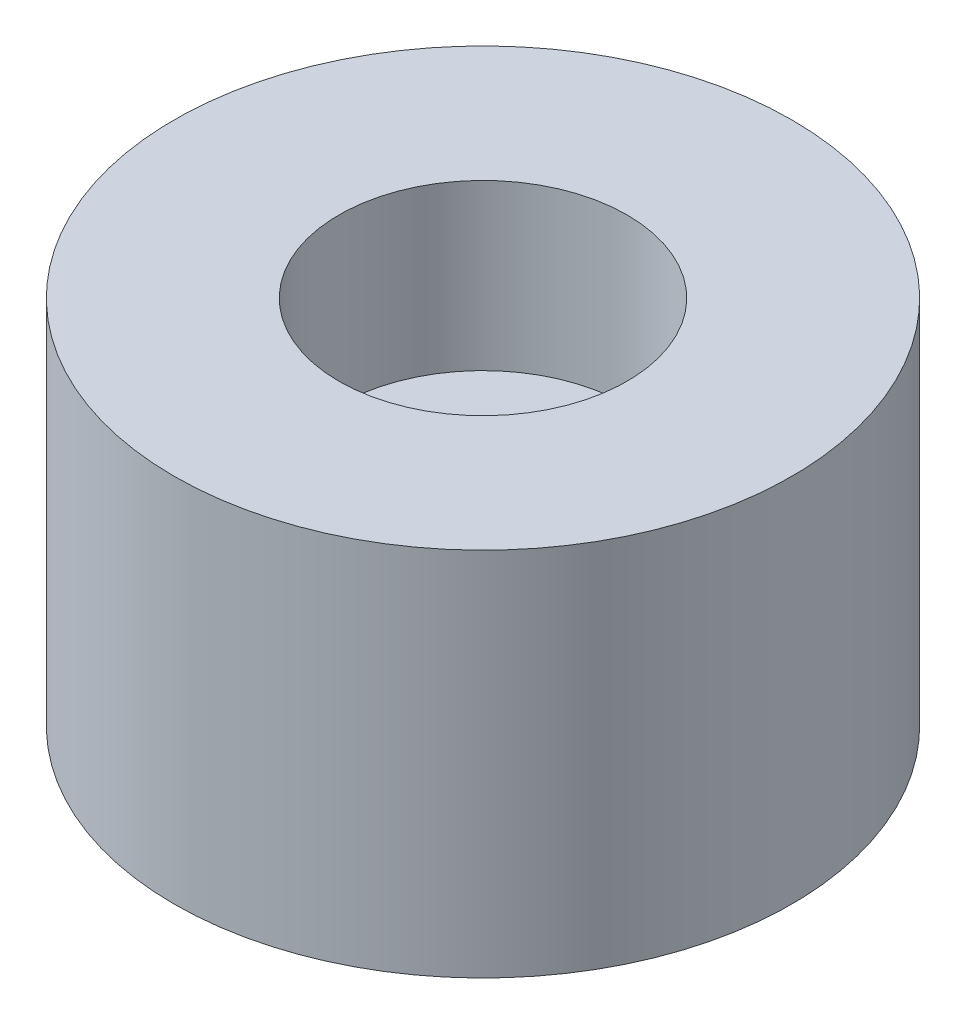
ISO-10303-21;
HEADER;
FILE_DESCRIPTION(('STEP AP214'),'2;1');
FILE_NAME('part.step','',(''),(''),'','','');
FILE_SCHEMA(('AUTOMOTIVE_DESIGN { 1 0 10303 214 1 1 1 1 }'));
ENDSEC;
DATA;
#1=APPLICATION_CONTEXT('core data for automotive mechanical design processes');
#2=APPLICATION_PROTOCOL_DEFINITION('international standard','automotive_design',2000,#1);
#3=PRODUCT_CONTEXT('',#1,'mechanical');
#4=PRODUCT('Part','Part','',(#3));
#5=PRODUCT_RELATED_PRODUCT_CATEGORY('part','',(#4));
#6=PRODUCT_DEFINITION_FORMATION('','',#4);
#7=PRODUCT_DEFINITION_CONTEXT('part definition',#1,'design');
#8=PRODUCT_DEFINITION('design','',#6,#7);
#9=PRODUCT_DEFINITION_SHAPE('','',#8);
#10=(LENGTH_UNIT() NAMED_UNIT(*) SI_UNIT(.MILLI.,.METRE.));
#11=(NAMED_UNIT(*) PLANE_ANGLE_UNIT() SI_UNIT($,.RADIAN.));
#12=(NAMED_UNIT(*) SI_UNIT($,.STERADIAN.) SOLID_ANGLE_UNIT());
#13=UNCERTAINTY_MEASURE_WITH_UNIT(LENGTH_MEASURE(1.E-05),#10,'distance_accuracy_value','');
#14=(GEOMETRIC_REPRESENTATION_CONTEXT(3) GLOBAL_UNCERTAINTY_ASSIGNED_CONTEXT((#13)) GLOBAL_UNIT_ASSIGNED_CONTEXT((#10,
#11,#12)) REPRESENTATION_CONTEXT('',''));
#15=CARTESIAN_POINT('',(0.,0.,0.));
#16=DIRECTION('',(0.,0.,1.));
#17=DIRECTION('',(1.,0.,0.));
#18=AXIS2_PLACEMENT_3D('',#15,#16,#17);
#19=CARTESIAN_POINT('',(0.,0.,0.));
#20=DIRECTION('',(0.,-1.,0.));
#21=DIRECTION('',(0.,0.,-1.));
#22=AXIS2_PLACEMENT_3D('',#19,#20,#21);
#23=CYLINDRICAL_SURFACE('',#22,7.5);
#24=CARTESIAN_POINT('',(0.,9.,0.));
#25=DIRECTION('',(0.,-1.,0.));
#26=DIRECTION('',(0.,0.,-1.));
#27=AXIS2_PLACEMENT_3D('',#24,#25,#26);
#28=CIRCLE('',#27,7.5);
#29=CARTESIAN_POINT('',(0.,9.,-7.5));
#30=VERTEX_POINT('',#29);
#31=EDGE_CURVE('E10',#30,#30,#28,.T.);
#32=ORIENTED_EDGE('',*,*,#31,.T.);
#33=EDGE_LOOP('',(#32));
#34=FACE_BOUND('',#33,.T.);
#35=CARTESIAN_POINT('',(0.,0.,0.));
#36=DIRECTION('',(0.,-1.,0.));
#37=DIRECTION('',(0.,0.,-1.));
#38=AXIS2_PLACEMENT_3D('',#35,#36,#37);
#39=CIRCLE('',#38,7.5);
#40=CARTESIAN_POINT('',(0.,0.,-7.5));
#41=VERTEX_POINT('',#40);
#42=EDGE_CURVE('E70',#41,#41,#39,.T.);
#43=ORIENTED_EDGE('',*,*,#42,.F.);
#44=EDGE_LOOP('',(#43));
#45=FACE_BOUND('',#44,.T.);
#46=ADVANCED_FACE('F43',(#34,#45),#23,.T.);
#47=CARTESIAN_POINT('',(7.5,9.,0.));
#48=DIRECTION('',(0.,1.,0.));
#49=DIRECTION('',(0.,0.,1.));
#50=AXIS2_PLACEMENT_3D('',#47,#48,#49);
#51=PLANE('',#50);
#52=CARTESIAN_POINT('',(0.,9.,0.));
#53=DIRECTION('',(0.,-1.,0.));
#54=DIRECTION('',(0.,0.,-1.));
#55=AXIS2_PLACEMENT_3D('',#52,#53,#54);
#56=CIRCLE('',#55,3.5);
#57=CARTESIAN_POINT('',(0.,9.,-3.5));
#58=VERTEX_POINT('',#57);
#59=EDGE_CURVE('E50',#58,#58,#56,.T.);
#60=ORIENTED_EDGE('',*,*,#59,.T.);
#61=EDGE_LOOP('',(#60));
#62=FACE_BOUND('',#61,.T.);
#63=ORIENTED_EDGE('',*,*,#31,.F.);
#64=EDGE_LOOP('',(#63));
#65=FACE_BOUND('',#64,.T.);
#66=ADVANCED_FACE('F79',(#62,#65),#51,.T.);
#67=CARTESIAN_POINT('',(0.,0.,0.));
#68=DIRECTION('',(0.,-1.,0.));
#69=DIRECTION('',(0.,0.,-1.));
#70=AXIS2_PLACEMENT_3D('',#67,#68,#69);
#71=CYLINDRICAL_SURFACE('',#70,3.5);
#72=CARTESIAN_POINT('',(0.,5.,0.));
#73=DIRECTION('',(0.,-1.,0.));
#74=DIRECTION('',(0.,0.,-1.));
#75=AXIS2_PLACEMENT_3D('',#72,#73,#74);
#76=CIRCLE('',#75,3.5);
#77=CARTESIAN_POINT('',(0.,5.,-3.5));
#78=VERTEX_POINT('',#77);
#79=EDGE_CURVE('E55',#78,#78,#76,.T.);
#80=ORIENTED_EDGE('',*,*,#79,.T.);
#81=EDGE_LOOP('',(#80));
#82=FACE_BOUND('',#81,.T.);
#83=ORIENTED_EDGE('',*,*,#59,.F.);
#84=EDGE_LOOP('',(#83));
#85=FACE_BOUND('',#84,.T.);
#86=ADVANCED_FACE('F83',(#82,#85),#71,.F.);
#87=CARTESIAN_POINT('',(3.5,5.,0.));
#88=DIRECTION('',(0.,1.,0.));
#89=DIRECTION('',(0.,0.,1.));
#90=AXIS2_PLACEMENT_3D('',#87,#88,#89);
#91=PLANE('',#90);
#92=CARTESIAN_POINT('',(0.,5.,0.));
#93=DIRECTION('',(0.,-1.,0.));
#94=DIRECTION('',(0.,0.,-1.));
#95=AXIS2_PLACEMENT_3D('',#92,#93,#94);
#96=CIRCLE('',#95,1.75);
#97=CARTESIAN_POINT('',(0.,5.,-1.75));
#98=VERTEX_POINT('',#97);
#99=EDGE_CURVE('E60',#98,#98,#96,.T.);
#100=ORIENTED_EDGE('',*,*,#99,.T.);
#101=EDGE_LOOP('',(#100));
#102=FACE_BOUND('',#101,.T.);
#103=ORIENTED_EDGE('',*,*,#79,.F.);
#104=EDGE_LOOP('',(#103));
#105=FACE_BOUND('',#104,.T.);
#106=ADVANCED_FACE('F87',(#102,#105),#91,.T.);
#107=CARTESIAN_POINT('',(0.,0.,0.));
#108=DIRECTION('',(0.,-1.,0.));
#109=DIRECTION('',(0.,0.,-1.));
#110=AXIS2_PLACEMENT_3D('',#107,#108,#109);
#111=CYLINDRICAL_SURFACE('',#110,1.75);
#112=CARTESIAN_POINT('',(0.,0.,0.));
#113=DIRECTION('',(0.,-1.,0.));
#114=DIRECTION('',(0.,0.,-1.));
#115=AXIS2_PLACEMENT_3D('',#112,#113,#114);
#116=CIRCLE('',#115,1.75);
#117=CARTESIAN_POINT('',(0.,0.,-1.75));
#118=VERTEX_POINT('',#117);
#119=EDGE_CURVE('E66',#118,#118,#116,.T.);
#120=ORIENTED_EDGE('',*,*,#119,.T.);
#121=EDGE_LOOP('',(#120));
#122=FACE_BOUND('',#121,.T.);
#123=ORIENTED_EDGE('',*,*,#99,.F.);
#124=EDGE_LOOP('',(#123));
#125=FACE_BOUND('',#124,.T.);
#126=ADVANCED_FACE('F94',(#122,#125),#111,.F.);
#127=CARTESIAN_POINT('',(1.75,0.,0.));
#128=DIRECTION('',(0.,-1.,0.));
#129=DIRECTION('',(0.,0.,-1.));
#130=AXIS2_PLACEMENT_3D('',#127,#128,#129);
#131=PLANE('',#130);
#132=ORIENTED_EDGE('',*,*,#42,.T.);
#133=EDGE_LOOP('',(#132));
#134=FACE_BOUND('',#133,.T.);
#135=ORIENTED_EDGE('',*,*,#119,.F.);
#136=EDGE_LOOP('',(#135));
#137=FACE_BOUND('',#136,.T.);
#138=ADVANCED_FACE('F75',(#134,#137),#131,.T.);
#139=CLOSED_SHELL('',(#46,#66,#86,#106,#126,#138));
#140=MANIFOLD_SOLID_BREP('B2',#139);
#141=ADVANCED_BREP_SHAPE_REPRESENTATION('',(#18,#140),#14);
#142=SHAPE_DEFINITION_REPRESENTATION(#9,#141);
ENDSEC;
END-ISO-10303-21;
